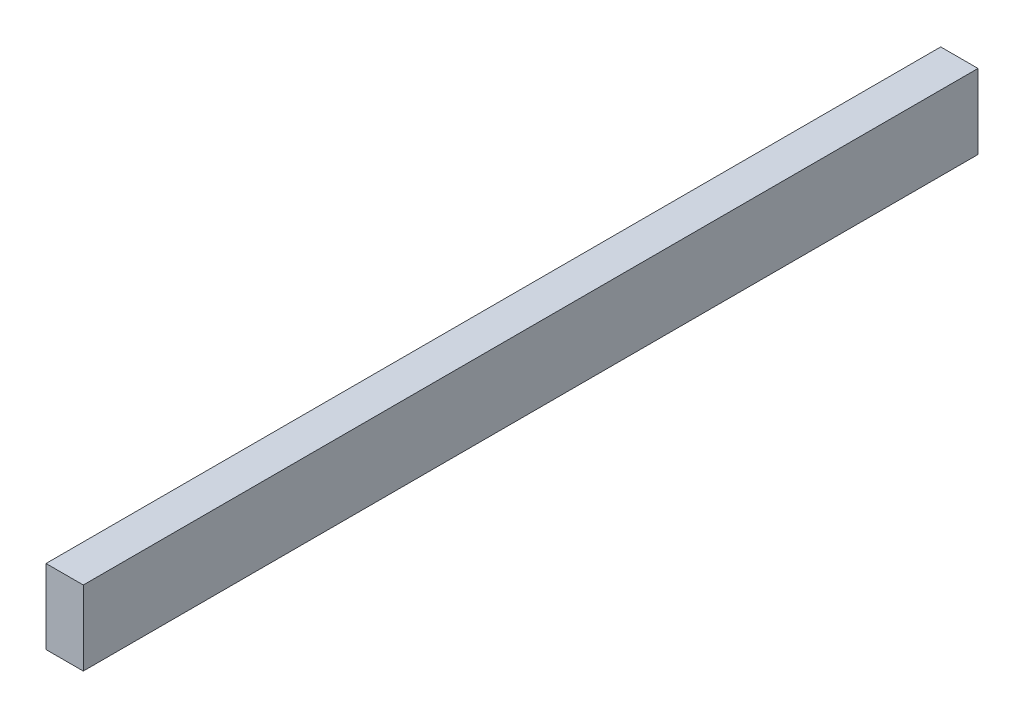
ISO-10303-21;
HEADER;
FILE_DESCRIPTION(('STEP AP214'),'2;1');
FILE_NAME('part.step','',(''),(''),'','','');
FILE_SCHEMA(('AUTOMOTIVE_DESIGN { 1 0 10303 214 1 1 1 1 }'));
ENDSEC;
DATA;
#1=APPLICATION_CONTEXT('core data for automotive mechanical design processes');
#2=APPLICATION_PROTOCOL_DEFINITION('international standard','automotive_design',2000,#1);
#3=PRODUCT_CONTEXT('',#1,'mechanical');
#4=PRODUCT('Part','Part','',(#3));
#5=PRODUCT_RELATED_PRODUCT_CATEGORY('part','',(#4));
#6=PRODUCT_DEFINITION_FORMATION('','',#4);
#7=PRODUCT_DEFINITION_CONTEXT('part definition',#1,'design');
#8=PRODUCT_DEFINITION('design','',#6,#7);
#9=PRODUCT_DEFINITION_SHAPE('','',#8);
#10=(LENGTH_UNIT() NAMED_UNIT(*) SI_UNIT(.MILLI.,.METRE.));
#11=(NAMED_UNIT(*) PLANE_ANGLE_UNIT() SI_UNIT($,.RADIAN.));
#12=(NAMED_UNIT(*) SI_UNIT($,.STERADIAN.) SOLID_ANGLE_UNIT());
#13=UNCERTAINTY_MEASURE_WITH_UNIT(LENGTH_MEASURE(1.E-05),#10,'distance_accuracy_value','');
#14=(GEOMETRIC_REPRESENTATION_CONTEXT(3) GLOBAL_UNCERTAINTY_ASSIGNED_CONTEXT((#13)) GLOBAL_UNIT_ASSIGNED_CONTEXT((#10,
#11,#12)) REPRESENTATION_CONTEXT('',''));
#15=CARTESIAN_POINT('',(0.,0.,0.));
#16=DIRECTION('',(0.,0.,1.));
#17=DIRECTION('',(1.,0.,0.));
#18=AXIS2_PLACEMENT_3D('',#15,#16,#17);
#19=CARTESIAN_POINT('',(0.,50.8,1.33226762955019E-12));
#20=DIRECTION('',(1.,0.,0.));
#21=DIRECTION('',(0.,0.,-1.));
#22=AXIS2_PLACEMENT_3D('',#19,#20,#21);
#23=PLANE('',#22);
#24=DIRECTION('',(0.,0.,1.));
#25=VECTOR('',#24,1.);
#26=CARTESIAN_POINT('',(0.,0.,0.));
#27=LINE('',#26,#25);
#28=CARTESIAN_POINT('',(2.22044604925031E-13,0.,-609.6));
#29=VERTEX_POINT('',#28);
#30=CARTESIAN_POINT('',(0.,0.,0.));
#31=VERTEX_POINT('',#30);
#32=EDGE_CURVE('E97',#29,#31,#27,.T.);
#33=ORIENTED_EDGE('',*,*,#32,.T.);
#34=DIRECTION('',(0.,-0.999999999999999,0.));
#35=VECTOR('',#34,1.);
#36=CARTESIAN_POINT('',(0.,50.8,1.33226762955019E-12));
#37=LINE('',#36,#35);
#38=CARTESIAN_POINT('',(0.,50.8,1.33226762955019E-12));
#39=VERTEX_POINT('',#38);
#40=EDGE_CURVE('E11',#39,#31,#37,.T.);
#41=ORIENTED_EDGE('',*,*,#40,.F.);
#42=DIRECTION('',(0.,0.,1.));
#43=VECTOR('',#42,1.);
#44=CARTESIAN_POINT('',(0.,50.8,1.33226762955019E-12));
#45=LINE('',#44,#43);
#46=CARTESIAN_POINT('',(2.22044604925031E-13,50.8,-609.599999999999));
#47=VERTEX_POINT('',#46);
#48=EDGE_CURVE('E85',#47,#39,#45,.T.);
#49=ORIENTED_EDGE('',*,*,#48,.F.);
#50=DIRECTION('',(0.,-0.999999999999999,0.));
#51=VECTOR('',#50,1.);
#52=CARTESIAN_POINT('',(2.22044604925031E-13,50.8,-609.599999999999));
#53=LINE('',#52,#51);
#54=EDGE_CURVE('E93',#47,#29,#53,.T.);
#55=ORIENTED_EDGE('',*,*,#54,.T.);
#56=EDGE_LOOP('',(#33,#41,#49,#55));
#57=FACE_BOUND('',#56,.T.);
#58=ADVANCED_FACE('F34',(#57),#23,.F.);
#59=CARTESIAN_POINT('',(0.,50.8,1.33226762955019E-12));
#60=DIRECTION('',(0.,0.,-1.));
#61=DIRECTION('',(-1.,0.,0.));
#62=AXIS2_PLACEMENT_3D('',#59,#60,#61);
#63=PLANE('',#62);
#64=DIRECTION('',(1.,0.,0.));
#65=VECTOR('',#64,1.);
#66=CARTESIAN_POINT('',(0.,0.,0.));
#67=LINE('',#66,#65);
#68=CARTESIAN_POINT('',(25.3999999999999,0.,0.));
#69=VERTEX_POINT('',#68);
#70=EDGE_CURVE('E89',#31,#69,#67,.T.);
#71=ORIENTED_EDGE('',*,*,#70,.T.);
#72=DIRECTION('',(0.,-0.999999999999999,0.));
#73=VECTOR('',#72,1.);
#74=CARTESIAN_POINT('',(25.3999999999999,50.8,0.));
#75=LINE('',#74,#73);
#76=CARTESIAN_POINT('',(25.3999999999999,50.8,0.));
#77=VERTEX_POINT('',#76);
#78=EDGE_CURVE('E42',#77,#69,#75,.T.);
#79=ORIENTED_EDGE('',*,*,#78,.F.);
#80=DIRECTION('',(1.,0.,0.));
#81=VECTOR('',#80,1.);
#82=CARTESIAN_POINT('',(0.,50.8,1.33226762955019E-12));
#83=LINE('',#82,#81);
#84=EDGE_CURVE('E80',#39,#77,#83,.T.);
#85=ORIENTED_EDGE('',*,*,#84,.F.);
#86=ORIENTED_EDGE('',*,*,#40,.T.);
#87=EDGE_LOOP('',(#71,#79,#85,#86));
#88=FACE_BOUND('',#87,.T.);
#89=ADVANCED_FACE('F88',(#88),#63,.F.);
#90=CARTESIAN_POINT('',(25.3999999999999,50.8,0.));
#91=DIRECTION('',(-1.,0.,0.));
#92=DIRECTION('',(0.,0.,1.));
#93=AXIS2_PLACEMENT_3D('',#90,#91,#92);
#94=PLANE('',#93);
#95=DIRECTION('',(0.,0.,-1.));
#96=VECTOR('',#95,1.);
#97=CARTESIAN_POINT('',(25.3999999999999,0.,0.));
#98=LINE('',#97,#96);
#99=CARTESIAN_POINT('',(25.4000000000005,0.,-609.6));
#100=VERTEX_POINT('',#99);
#101=EDGE_CURVE('E67',#69,#100,#98,.T.);
#102=ORIENTED_EDGE('',*,*,#101,.T.);
#103=DIRECTION('',(0.,-0.999999999999999,0.));
#104=VECTOR('',#103,1.);
#105=CARTESIAN_POINT('',(25.4000000000005,50.8,-609.6));
#106=LINE('',#105,#104);
#107=CARTESIAN_POINT('',(25.4000000000005,50.8,-609.6));
#108=VERTEX_POINT('',#107);
#109=EDGE_CURVE('E90',#108,#100,#106,.T.);
#110=ORIENTED_EDGE('',*,*,#109,.F.);
#111=DIRECTION('',(0.,0.,-1.));
#112=VECTOR('',#111,1.);
#113=CARTESIAN_POINT('',(25.3999999999999,50.8,0.));
#114=LINE('',#113,#112);
#115=EDGE_CURVE('E83',#77,#108,#114,.T.);
#116=ORIENTED_EDGE('',*,*,#115,.F.);
#117=ORIENTED_EDGE('',*,*,#78,.T.);
#118=EDGE_LOOP('',(#102,#110,#116,#117));
#119=FACE_BOUND('',#118,.T.);
#120=ADVANCED_FACE('F91',(#119),#94,.F.);
#121=CARTESIAN_POINT('',(2.22044604925031E-13,50.8,-609.599999999999));
#122=DIRECTION('',(0.,0.,1.));
#123=DIRECTION('',(1.,0.,0.));
#124=AXIS2_PLACEMENT_3D('',#121,#122,#123);
#125=PLANE('',#124);
#126=DIRECTION('',(-1.,0.,0.));
#127=VECTOR('',#126,1.);
#128=CARTESIAN_POINT('',(2.22044604925031E-13,0.,-609.6));
#129=LINE('',#128,#127);
#130=EDGE_CURVE('E73',#100,#29,#129,.T.);
#131=ORIENTED_EDGE('',*,*,#130,.T.);
#132=ORIENTED_EDGE('',*,*,#54,.F.);
#133=DIRECTION('',(-1.,0.,0.));
#134=VECTOR('',#133,1.);
#135=CARTESIAN_POINT('',(2.22044604925031E-13,50.8,-609.599999999999));
#136=LINE('',#135,#134);
#137=EDGE_CURVE('E50',#108,#47,#136,.T.);
#138=ORIENTED_EDGE('',*,*,#137,.F.);
#139=ORIENTED_EDGE('',*,*,#109,.T.);
#140=EDGE_LOOP('',(#131,#132,#138,#139));
#141=FACE_BOUND('',#140,.T.);
#142=ADVANCED_FACE('F104',(#141),#125,.F.);
#143=CARTESIAN_POINT('',(0.,50.8,1.33226762955019E-12));
#144=DIRECTION('',(0.,-0.999999999999999,0.));
#145=DIRECTION('',(0.,0.,-1.));
#146=AXIS2_PLACEMENT_3D('',#143,#144,#145);
#147=PLANE('',#146);
#148=ORIENTED_EDGE('',*,*,#48,.T.);
#149=ORIENTED_EDGE('',*,*,#84,.T.);
#150=ORIENTED_EDGE('',*,*,#115,.T.);
#151=ORIENTED_EDGE('',*,*,#137,.T.);
#152=EDGE_LOOP('',(#148,#149,#150,#151));
#153=FACE_BOUND('',#152,.T.);
#154=ADVANCED_FACE('F81',(#153),#147,.F.);
#155=CARTESIAN_POINT('',(0.,0.,0.));
#156=DIRECTION('',(0.,-0.999999999999999,0.));
#157=DIRECTION('',(0.,0.,-1.));
#158=AXIS2_PLACEMENT_3D('',#155,#156,#157);
#159=PLANE('',#158);
#160=ORIENTED_EDGE('',*,*,#32,.F.);
#161=ORIENTED_EDGE('',*,*,#130,.F.);
#162=ORIENTED_EDGE('',*,*,#101,.F.);
#163=ORIENTED_EDGE('',*,*,#70,.F.);
#164=EDGE_LOOP('',(#160,#161,#162,#163));
#165=FACE_BOUND('',#164,.T.);
#166=ADVANCED_FACE('F107',(#165),#159,.T.);
#167=CLOSED_SHELL('',(#58,#89,#120,#142,#154,#166));
#168=MANIFOLD_SOLID_BREP('B2',#167);
#169=ADVANCED_BREP_SHAPE_REPRESENTATION('',(#18,#168),#14);
#170=SHAPE_DEFINITION_REPRESENTATION(#9,#169);
ENDSEC;
END-ISO-10303-21;
